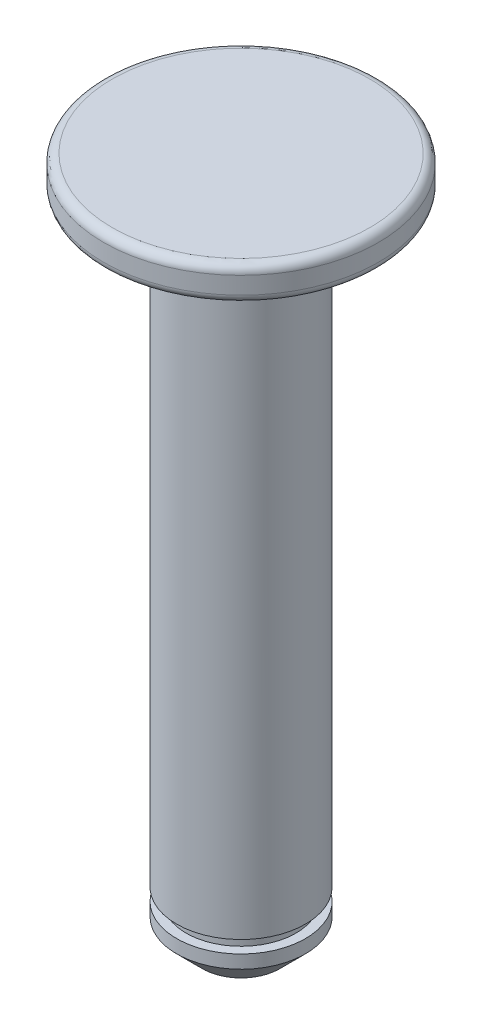
ISO-10303-21;
HEADER;
FILE_DESCRIPTION(('STEP AP214'),'2;1');
FILE_NAME('part.step','',(''),(''),'','','');
FILE_SCHEMA(('AUTOMOTIVE_DESIGN { 1 0 10303 214 1 1 1 1 }'));
ENDSEC;
DATA;
#1=APPLICATION_CONTEXT('core data for automotive mechanical design processes');
#2=APPLICATION_PROTOCOL_DEFINITION('international standard','automotive_design',2000,#1);
#3=PRODUCT_CONTEXT('',#1,'mechanical');
#4=PRODUCT('Part','Part','',(#3));
#5=PRODUCT_RELATED_PRODUCT_CATEGORY('part','',(#4));
#6=PRODUCT_DEFINITION_FORMATION('','',#4);
#7=PRODUCT_DEFINITION_CONTEXT('part definition',#1,'design');
#8=PRODUCT_DEFINITION('design','',#6,#7);
#9=PRODUCT_DEFINITION_SHAPE('','',#8);
#10=(LENGTH_UNIT() NAMED_UNIT(*) SI_UNIT(.MILLI.,.METRE.));
#11=(NAMED_UNIT(*) PLANE_ANGLE_UNIT() SI_UNIT($,.RADIAN.));
#12=(NAMED_UNIT(*) SI_UNIT($,.STERADIAN.) SOLID_ANGLE_UNIT());
#13=UNCERTAINTY_MEASURE_WITH_UNIT(LENGTH_MEASURE(1.E-05),#10,'distance_accuracy_value','');
#14=(GEOMETRIC_REPRESENTATION_CONTEXT(3) GLOBAL_UNCERTAINTY_ASSIGNED_CONTEXT((#13)) GLOBAL_UNIT_ASSIGNED_CONTEXT((#10,
#11,#12)) REPRESENTATION_CONTEXT('',''));
#15=CARTESIAN_POINT('',(0.,0.,0.));
#16=DIRECTION('',(0.,0.,1.));
#17=DIRECTION('',(1.,0.,0.));
#18=AXIS2_PLACEMENT_3D('',#15,#16,#17);
#19=CARTESIAN_POINT('',(0.,-2.,0.));
#20=DIRECTION('',(0.,1.,0.));
#21=DIRECTION('',(0.,0.,1.));
#22=AXIS2_PLACEMENT_3D('',#19,#20,#21);
#23=CYLINDRICAL_SURFACE('',#22,8.);
#24=CARTESIAN_POINT('',(0.,-1.5,0.));
#25=DIRECTION('',(0.,1.,0.));
#26=DIRECTION('',(0.,0.,1.));
#27=AXIS2_PLACEMENT_3D('',#24,#25,#26);
#28=CIRCLE('',#27,8.);
#29=CARTESIAN_POINT('',(0.,-1.5,8.));
#30=VERTEX_POINT('',#29);
#31=EDGE_CURVE('E102',#30,#30,#28,.T.);
#32=ORIENTED_EDGE('',*,*,#31,.T.);
#33=EDGE_LOOP('',(#32));
#34=FACE_BOUND('',#33,.T.);
#35=CARTESIAN_POINT('',(0.,-0.5,0.));
#36=DIRECTION('',(0.,1.,0.));
#37=DIRECTION('',(0.,0.,1.));
#38=AXIS2_PLACEMENT_3D('',#35,#36,#37);
#39=CIRCLE('',#38,8.);
#40=CARTESIAN_POINT('',(0.,-0.5,8.));
#41=VERTEX_POINT('',#40);
#42=EDGE_CURVE('E92',#41,#41,#39,.F.);
#43=ORIENTED_EDGE('',*,*,#42,.T.);
#44=EDGE_LOOP('',(#43));
#45=FACE_BOUND('',#44,.T.);
#46=ADVANCED_FACE('F37',(#34,#45),#23,.T.);
#47=CARTESIAN_POINT('',(0.,-2.,0.));
#48=DIRECTION('',(0.,1.,0.));
#49=DIRECTION('',(0.,0.,1.));
#50=AXIS2_PLACEMENT_3D('',#47,#48,#49);
#51=PLANE('',#50);
#52=CARTESIAN_POINT('',(0.,-2.,0.));
#53=DIRECTION('',(0.,1.,0.));
#54=DIRECTION('',(0.,0.,1.));
#55=AXIS2_PLACEMENT_3D('',#52,#53,#54);
#56=CIRCLE('',#55,7.5);
#57=CARTESIAN_POINT('',(0.,-2.,7.5));
#58=VERTEX_POINT('',#57);
#59=EDGE_CURVE('E105',#58,#58,#56,.F.);
#60=ORIENTED_EDGE('',*,*,#59,.T.);
#61=EDGE_LOOP('',(#60));
#62=FACE_BOUND('',#61,.T.);
#63=DIRECTION('',(1.,0.,0.));
#64=VECTOR('',#63,1.);
#65=CARTESIAN_POINT('',(0.,-2.,-1.));
#66=LINE('',#65,#64);
#67=CARTESIAN_POINT('',(3.61420807370024,-2.,-1.));
#68=VERTEX_POINT('',#67);
#69=CARTESIAN_POINT('',(5.74999999999998,-2.,-1.));
#70=VERTEX_POINT('',#69);
#71=EDGE_CURVE('E78',#68,#70,#66,.T.);
#72=ORIENTED_EDGE('',*,*,#71,.F.);
#73=CARTESIAN_POINT('',(0.,-2.,0.));
#74=DIRECTION('',(0.,-1.,0.));
#75=DIRECTION('',(0.,0.,-1.));
#76=AXIS2_PLACEMENT_3D('',#73,#74,#75);
#77=CIRCLE('',#76,3.75);
#78=CARTESIAN_POINT('',(3.61420807370024,-2.,1.));
#79=VERTEX_POINT('',#78);
#80=EDGE_CURVE('E70',#79,#68,#77,.T.);
#81=ORIENTED_EDGE('',*,*,#80,.F.);
#82=DIRECTION('',(1.,0.,0.));
#83=VECTOR('',#82,1.);
#84=CARTESIAN_POINT('',(0.,-2.,1.));
#85=LINE('',#84,#83);
#86=CARTESIAN_POINT('',(5.74999999999998,-2.,1.));
#87=VERTEX_POINT('',#86);
#88=EDGE_CURVE('E52',#79,#87,#85,.T.);
#89=ORIENTED_EDGE('',*,*,#88,.T.);
#90=DIRECTION('',(0.,0.,1.));
#91=VECTOR('',#90,1.);
#92=CARTESIAN_POINT('',(5.74999999999998,-2.,0.));
#93=LINE('',#92,#91);
#94=EDGE_CURVE('E56',#87,#70,#93,.F.);
#95=ORIENTED_EDGE('',*,*,#94,.T.);
#96=EDGE_LOOP('',(#72,#81,#89,#95));
#97=FACE_BOUND('',#96,.T.);
#98=ADVANCED_FACE('F79',(#62,#97),#51,.F.);
#99=CARTESIAN_POINT('',(0.,0.,0.));
#100=DIRECTION('',(0.,1.,0.));
#101=DIRECTION('',(0.,0.,1.));
#102=AXIS2_PLACEMENT_3D('',#99,#100,#101);
#103=PLANE('',#102);
#104=CARTESIAN_POINT('',(0.,0.,0.));
#105=DIRECTION('',(0.,1.,0.));
#106=DIRECTION('',(0.,0.,1.));
#107=AXIS2_PLACEMENT_3D('',#104,#105,#106);
#108=CIRCLE('',#107,7.5);
#109=CARTESIAN_POINT('',(0.,0.,7.5));
#110=VERTEX_POINT('',#109);
#111=EDGE_CURVE('E108',#110,#110,#108,.T.);
#112=ORIENTED_EDGE('',*,*,#111,.T.);
#113=EDGE_LOOP('',(#112));
#114=FACE_BOUND('',#113,.T.);
#115=ADVANCED_FACE('F130',(#114),#103,.T.);
#116=CARTESIAN_POINT('',(0.,-40.,0.));
#117=DIRECTION('',(0.,1.,0.));
#118=DIRECTION('',(0.,0.,1.));
#119=AXIS2_PLACEMENT_3D('',#116,#117,#118);
#120=CYLINDRICAL_SURFACE('',#119,3.75);
#121=CARTESIAN_POINT('',(0.,-37.,0.));
#122=DIRECTION('',(0.,1.,0.));
#123=DIRECTION('',(0.,0.,1.));
#124=AXIS2_PLACEMENT_3D('',#121,#122,#123);
#125=CIRCLE('',#124,3.75);
#126=CARTESIAN_POINT('',(0.,-37.,3.75));
#127=VERTEX_POINT('',#126);
#128=EDGE_CURVE('E93',#127,#127,#125,.T.);
#129=ORIENTED_EDGE('',*,*,#128,.T.);
#130=EDGE_LOOP('',(#129));
#131=FACE_BOUND('',#130,.T.);
#132=CARTESIAN_POINT('',(0.,-7.75000000000004,0.));
#133=DIRECTION('',(-0.707106781186551,0.707106781186544,0.));
#134=DIRECTION('',(0.707106781186544,0.707106781186551,0.));
#135=AXIS2_PLACEMENT_3D('',#132,#133,#134);
#136=ELLIPSE('',#135,5.30330085889913,3.75);
#137=CARTESIAN_POINT('',(3.61420807370024,-4.13579192629976,-1.));
#138=VERTEX_POINT('',#137);
#139=CARTESIAN_POINT('',(3.61420807370024,-4.13579192629976,1.));
#140=VERTEX_POINT('',#139);
#141=EDGE_CURVE('E87',#138,#140,#136,.F.);
#142=ORIENTED_EDGE('',*,*,#141,.T.);
#143=DIRECTION('',(0.,1.,0.));
#144=VECTOR('',#143,1.);
#145=CARTESIAN_POINT('',(3.61420807370024,-40.,1.));
#146=LINE('',#145,#144);
#147=EDGE_CURVE('E76',#140,#79,#146,.T.);
#148=ORIENTED_EDGE('',*,*,#147,.T.);
#149=ORIENTED_EDGE('',*,*,#80,.T.);
#150=DIRECTION('',(0.,1.,0.));
#151=VECTOR('',#150,1.);
#152=CARTESIAN_POINT('',(3.61420807370024,-40.,-1.));
#153=LINE('',#152,#151);
#154=EDGE_CURVE('E73',#138,#68,#153,.T.);
#155=ORIENTED_EDGE('',*,*,#154,.F.);
#156=EDGE_LOOP('',(#142,#148,#149,#155));
#157=FACE_BOUND('',#156,.T.);
#158=ADVANCED_FACE('F71',(#131,#157),#120,.T.);
#159=CARTESIAN_POINT('',(5.74999999999998,-2.,0.));
#160=DIRECTION('',(-0.707106781186551,0.707106781186544,0.));
#161=DIRECTION('',(-0.707106781186544,-0.707106781186551,0.));
#162=AXIS2_PLACEMENT_3D('',#159,#160,#161);
#163=PLANE('',#162);
#164=ORIENTED_EDGE('',*,*,#94,.F.);
#165=DIRECTION('',(-0.707106781186544,-0.707106781186551,0.));
#166=VECTOR('',#165,1.);
#167=CARTESIAN_POINT('',(5.74999999999998,-2.,1.));
#168=LINE('',#167,#166);
#169=EDGE_CURVE('E83',#87,#140,#168,.T.);
#170=ORIENTED_EDGE('',*,*,#169,.T.);
#171=ORIENTED_EDGE('',*,*,#141,.F.);
#172=DIRECTION('',(-0.707106781186544,-0.707106781186551,0.));
#173=VECTOR('',#172,1.);
#174=CARTESIAN_POINT('',(5.74999999999998,-2.,-1.));
#175=LINE('',#174,#173);
#176=EDGE_CURVE('E86',#70,#138,#175,.T.);
#177=ORIENTED_EDGE('',*,*,#176,.F.);
#178=EDGE_LOOP('',(#164,#170,#171,#177));
#179=FACE_BOUND('',#178,.T.);
#180=ADVANCED_FACE('F154',(#179),#163,.F.);
#181=CARTESIAN_POINT('',(0.,-20.,1.));
#182=DIRECTION('',(0.,0.,1.));
#183=DIRECTION('',(1.,0.,0.));
#184=AXIS2_PLACEMENT_3D('',#181,#182,#183);
#185=PLANE('',#184);
#186=ORIENTED_EDGE('',*,*,#88,.F.);
#187=ORIENTED_EDGE('',*,*,#147,.F.);
#188=ORIENTED_EDGE('',*,*,#169,.F.);
#189=EDGE_LOOP('',(#186,#187,#188));
#190=FACE_BOUND('',#189,.T.);
#191=ADVANCED_FACE('F160',(#190),#185,.T.);
#192=CARTESIAN_POINT('',(0.,-20.,-1.));
#193=DIRECTION('',(0.,0.,1.));
#194=DIRECTION('',(1.,0.,0.));
#195=AXIS2_PLACEMENT_3D('',#192,#193,#194);
#196=PLANE('',#195);
#197=ORIENTED_EDGE('',*,*,#154,.T.);
#198=ORIENTED_EDGE('',*,*,#71,.T.);
#199=ORIENTED_EDGE('',*,*,#176,.T.);
#200=EDGE_LOOP('',(#197,#198,#199));
#201=FACE_BOUND('',#200,.T.);
#202=ADVANCED_FACE('F85',(#201),#196,.F.);
#203=CARTESIAN_POINT('',(0.,-37.73,-5.2));
#204=DIRECTION('',(0.,-1.,0.));
#205=DIRECTION('',(0.,0.,-1.));
#206=AXIS2_PLACEMENT_3D('',#203,#204,#205);
#207=PLANE('',#206);
#208=CARTESIAN_POINT('',(0.,-37.73,0.));
#209=DIRECTION('',(0.,-1.,0.));
#210=DIRECTION('',(0.,0.,-1.));
#211=AXIS2_PLACEMENT_3D('',#208,#209,#210);
#212=CIRCLE('',#211,3.2);
#213=CARTESIAN_POINT('',(0.,-37.73,-3.2));
#214=VERTEX_POINT('',#213);
#215=EDGE_CURVE('E97',#214,#214,#212,.T.);
#216=ORIENTED_EDGE('',*,*,#215,.T.);
#217=EDGE_LOOP('',(#216));
#218=FACE_BOUND('',#217,.T.);
#219=CARTESIAN_POINT('',(0.,-37.73,0.));
#220=DIRECTION('',(0.,-1.,0.));
#221=DIRECTION('',(0.,0.,-1.));
#222=AXIS2_PLACEMENT_3D('',#219,#220,#221);
#223=CIRCLE('',#222,3.75);
#224=CARTESIAN_POINT('',(0.,-37.73,-3.75));
#225=VERTEX_POINT('',#224);
#226=EDGE_CURVE('E96',#225,#225,#223,.T.);
#227=ORIENTED_EDGE('',*,*,#226,.F.);
#228=EDGE_LOOP('',(#227));
#229=FACE_BOUND('',#228,.T.);
#230=ADVANCED_FACE('F168',(#218,#229),#207,.F.);
#231=CARTESIAN_POINT('',(0.,-37.,-5.2));
#232=DIRECTION('',(0.,1.,0.));
#233=DIRECTION('',(0.,0.,1.));
#234=AXIS2_PLACEMENT_3D('',#231,#232,#233);
#235=PLANE('',#234);
#236=CARTESIAN_POINT('',(0.,-37.,0.));
#237=DIRECTION('',(0.,-1.,0.));
#238=DIRECTION('',(0.,0.,-1.));
#239=AXIS2_PLACEMENT_3D('',#236,#237,#238);
#240=CIRCLE('',#239,3.2);
#241=CARTESIAN_POINT('',(0.,-37.,-3.2));
#242=VERTEX_POINT('',#241);
#243=EDGE_CURVE('E272',#242,#242,#240,.T.);
#244=ORIENTED_EDGE('',*,*,#243,.F.);
#245=EDGE_LOOP('',(#244));
#246=FACE_BOUND('',#245,.T.);
#247=ORIENTED_EDGE('',*,*,#128,.F.);
#248=EDGE_LOOP('',(#247));
#249=FACE_BOUND('',#248,.T.);
#250=ADVANCED_FACE('F166',(#246,#249),#235,.F.);
#251=CARTESIAN_POINT('',(0.,-40.,0.));
#252=DIRECTION('',(0.,-1.,0.));
#253=DIRECTION('',(0.,0.,-1.));
#254=AXIS2_PLACEMENT_3D('',#251,#252,#253);
#255=CYLINDRICAL_SURFACE('',#254,3.2);
#256=ORIENTED_EDGE('',*,*,#215,.F.);
#257=EDGE_LOOP('',(#256));
#258=FACE_BOUND('',#257,.T.);
#259=ORIENTED_EDGE('',*,*,#243,.T.);
#260=EDGE_LOOP('',(#259));
#261=FACE_BOUND('',#260,.T.);
#262=ADVANCED_FACE('F150',(#258,#261),#255,.T.);
#263=CARTESIAN_POINT('',(0.,-40.,0.));
#264=DIRECTION('',(0.,-1.,0.));
#265=DIRECTION('',(0.,0.,-1.));
#266=AXIS2_PLACEMENT_3D('',#263,#264,#265);
#267=PLANE('',#266);
#268=CARTESIAN_POINT('',(0.,-40.,0.));
#269=DIRECTION('',(0.,-1.,0.));
#270=DIRECTION('',(0.,0.,-1.));
#271=AXIS2_PLACEMENT_3D('',#268,#269,#270);
#272=CIRCLE('',#271,2.24999999999999);
#273=CARTESIAN_POINT('',(0.,-40.,-2.24999999999999));
#274=VERTEX_POINT('',#273);
#275=EDGE_CURVE('E45',#274,#274,#272,.T.);
#276=ORIENTED_EDGE('',*,*,#275,.T.);
#277=EDGE_LOOP('',(#276));
#278=FACE_BOUND('',#277,.T.);
#279=ADVANCED_FACE('F113',(#278),#267,.T.);
#280=CARTESIAN_POINT('',(0.,-38.5,0.));
#281=DIRECTION('',(0.,-1.,0.));
#282=DIRECTION('',(0.,0.,-1.));
#283=AXIS2_PLACEMENT_3D('',#280,#281,#282);
#284=CIRCLE('',#283,3.75);
#285=CARTESIAN_POINT('',(0.,-38.5,-3.75));
#286=VERTEX_POINT('',#285);
#287=EDGE_CURVE('E11',#286,#286,#284,.F.);
#288=ORIENTED_EDGE('',*,*,#287,.T.);
#289=EDGE_LOOP('',(#288));
#290=FACE_BOUND('',#289,.T.);
#291=ORIENTED_EDGE('',*,*,#226,.T.);
#292=EDGE_LOOP('',(#291));
#293=FACE_BOUND('',#292,.T.);
#294=ADVANCED_FACE('F137',(#290,#293),#120,.T.);
#295=CARTESIAN_POINT('',(0.,-1.5,0.));
#296=DIRECTION('',(0.,1.,0.));
#297=DIRECTION('',(0.,0.,1.));
#298=AXIS2_PLACEMENT_3D('',#295,#296,#297);
#299=TOROIDAL_SURFACE('',#298,7.5,0.5);
#300=ORIENTED_EDGE('',*,*,#59,.F.);
#301=EDGE_LOOP('',(#300));
#302=FACE_BOUND('',#301,.T.);
#303=ORIENTED_EDGE('',*,*,#31,.F.);
#304=EDGE_LOOP('',(#303));
#305=FACE_BOUND('',#304,.T.);
#306=ADVANCED_FACE('F121',(#302,#305),#299,.T.);
#307=CARTESIAN_POINT('',(0.,-0.5,0.));
#308=DIRECTION('',(0.,1.,0.));
#309=DIRECTION('',(0.,0.,1.));
#310=AXIS2_PLACEMENT_3D('',#307,#308,#309);
#311=TOROIDAL_SURFACE('',#310,7.5,0.5);
#312=ORIENTED_EDGE('',*,*,#42,.F.);
#313=EDGE_LOOP('',(#312));
#314=FACE_BOUND('',#313,.T.);
#315=ORIENTED_EDGE('',*,*,#111,.F.);
#316=EDGE_LOOP('',(#315));
#317=FACE_BOUND('',#316,.T.);
#318=ADVANCED_FACE('F116',(#314,#317),#311,.T.);
#319=CARTESIAN_POINT('',(0.,-40.,0.));
#320=DIRECTION('',(0.,1.,0.));
#321=DIRECTION('',(0.,0.,1.));
#322=AXIS2_PLACEMENT_3D('',#319,#320,#321);
#323=CONICAL_SURFACE('',#322,2.24999999999999,0.785398163397447);
#324=ORIENTED_EDGE('',*,*,#287,.F.);
#325=EDGE_LOOP('',(#324));
#326=FACE_BOUND('',#325,.T.);
#327=ORIENTED_EDGE('',*,*,#275,.F.);
#328=EDGE_LOOP('',(#327));
#329=FACE_BOUND('',#328,.T.);
#330=ADVANCED_FACE('F39',(#326,#329),#323,.T.);
#331=CLOSED_SHELL('',(#46,#98,#115,#158,#180,#191,#202,#230,#250,#262,#279,#294,#306,#318,#330));
#332=MANIFOLD_SOLID_BREP('B2',#331);
#333=ADVANCED_BREP_SHAPE_REPRESENTATION('',(#18,#332),#14);
#334=SHAPE_DEFINITION_REPRESENTATION(#9,#333);
ENDSEC;
END-ISO-10303-21;
